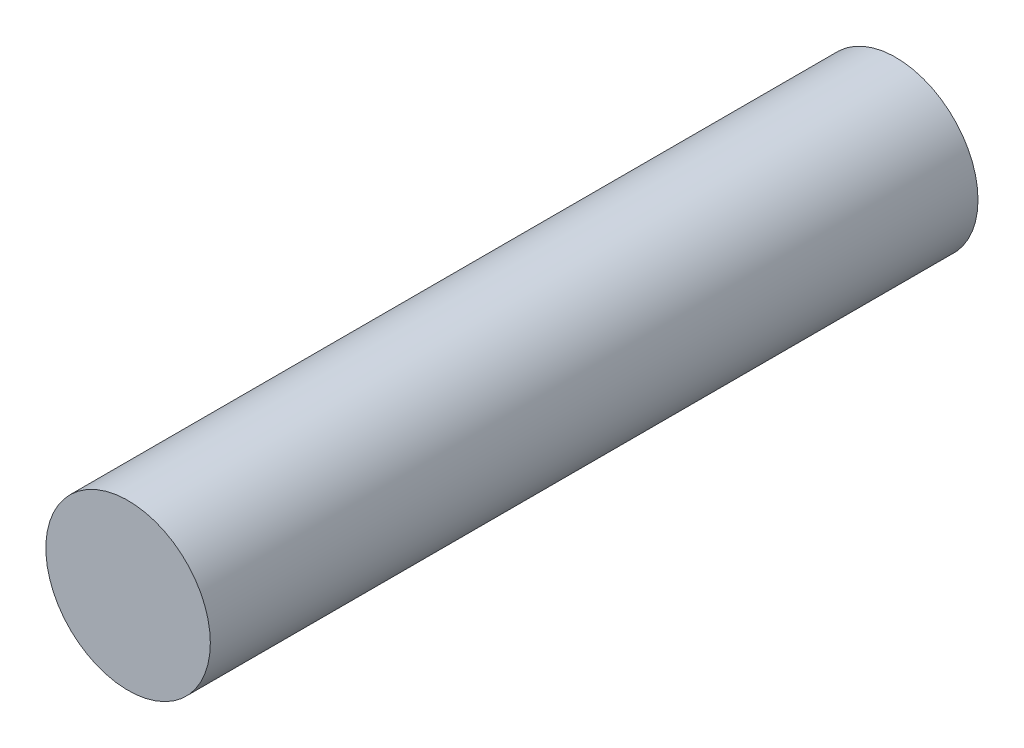
ISO-10303-21;
HEADER;
FILE_DESCRIPTION(('STEP AP214'),'2;1');
FILE_NAME('part.step','',(''),(''),'','','');
FILE_SCHEMA(('AUTOMOTIVE_DESIGN { 1 0 10303 214 1 1 1 1 }'));
ENDSEC;
DATA;
#1=APPLICATION_CONTEXT('core data for automotive mechanical design processes');
#2=APPLICATION_PROTOCOL_DEFINITION('international standard','automotive_design',2000,#1);
#3=PRODUCT_CONTEXT('',#1,'mechanical');
#4=PRODUCT('Part','Part','',(#3));
#5=PRODUCT_RELATED_PRODUCT_CATEGORY('part','',(#4));
#6=PRODUCT_DEFINITION_FORMATION('','',#4);
#7=PRODUCT_DEFINITION_CONTEXT('part definition',#1,'design');
#8=PRODUCT_DEFINITION('design','',#6,#7);
#9=PRODUCT_DEFINITION_SHAPE('','',#8);
#10=(LENGTH_UNIT() NAMED_UNIT(*) SI_UNIT(.MILLI.,.METRE.));
#11=(NAMED_UNIT(*) PLANE_ANGLE_UNIT() SI_UNIT($,.RADIAN.));
#12=(NAMED_UNIT(*) SI_UNIT($,.STERADIAN.) SOLID_ANGLE_UNIT());
#13=UNCERTAINTY_MEASURE_WITH_UNIT(LENGTH_MEASURE(1.E-05),#10,'distance_accuracy_value','');
#14=(GEOMETRIC_REPRESENTATION_CONTEXT(3) GLOBAL_UNCERTAINTY_ASSIGNED_CONTEXT((#13)) GLOBAL_UNIT_ASSIGNED_CONTEXT((#10,
#11,#12)) REPRESENTATION_CONTEXT('',''));
#15=CARTESIAN_POINT('',(0.,0.,0.));
#16=DIRECTION('',(0.,0.,1.));
#17=DIRECTION('',(1.,0.,0.));
#18=AXIS2_PLACEMENT_3D('',#15,#16,#17);
#19=CARTESIAN_POINT('',(0.,0.,14.));
#20=DIRECTION('',(0.,0.,-1.));
#21=DIRECTION('',(-1.,0.,0.));
#22=AXIS2_PLACEMENT_3D('',#19,#20,#21);
#23=CYLINDRICAL_SURFACE('',#22,1.5);
#24=CARTESIAN_POINT('',(0.,0.,14.));
#25=DIRECTION('',(0.,0.,1.));
#26=DIRECTION('',(1.,0.,0.));
#27=AXIS2_PLACEMENT_3D('',#24,#25,#26);
#28=CIRCLE('',#27,1.5);
#29=CARTESIAN_POINT('',(1.5,0.,14.));
#30=VERTEX_POINT('',#29);
#31=EDGE_CURVE('E10',#30,#30,#28,.T.);
#32=ORIENTED_EDGE('',*,*,#31,.F.);
#33=EDGE_LOOP('',(#32));
#34=FACE_BOUND('',#33,.T.);
#35=CARTESIAN_POINT('',(0.,0.,0.));
#36=DIRECTION('',(0.,0.,1.));
#37=DIRECTION('',(1.,0.,0.));
#38=AXIS2_PLACEMENT_3D('',#35,#36,#37);
#39=CIRCLE('',#38,1.5);
#40=CARTESIAN_POINT('',(1.5,0.,0.));
#41=VERTEX_POINT('',#40);
#42=EDGE_CURVE('E44',#41,#41,#39,.T.);
#43=ORIENTED_EDGE('',*,*,#42,.T.);
#44=EDGE_LOOP('',(#43));
#45=FACE_BOUND('',#44,.T.);
#46=ADVANCED_FACE('F41',(#34,#45),#23,.T.);
#47=CARTESIAN_POINT('',(0.,0.,14.));
#48=DIRECTION('',(0.,0.,1.));
#49=DIRECTION('',(1.,0.,0.));
#50=AXIS2_PLACEMENT_3D('',#47,#48,#49);
#51=PLANE('',#50);
#52=ORIENTED_EDGE('',*,*,#31,.T.);
#53=EDGE_LOOP('',(#52));
#54=FACE_BOUND('',#53,.T.);
#55=ADVANCED_FACE('F58',(#54),#51,.T.);
#56=CARTESIAN_POINT('',(0.,0.,0.));
#57=DIRECTION('',(0.,0.,1.));
#58=DIRECTION('',(1.,0.,0.));
#59=AXIS2_PLACEMENT_3D('',#56,#57,#58);
#60=PLANE('',#59);
#61=ORIENTED_EDGE('',*,*,#42,.F.);
#62=EDGE_LOOP('',(#61));
#63=FACE_BOUND('',#62,.T.);
#64=ADVANCED_FACE('F56',(#63),#60,.F.);
#65=CLOSED_SHELL('',(#46,#55,#64));
#66=MANIFOLD_SOLID_BREP('B2',#65);
#67=ADVANCED_BREP_SHAPE_REPRESENTATION('',(#18,#66),#14);
#68=SHAPE_DEFINITION_REPRESENTATION(#9,#67);
ENDSEC;
END-ISO-10303-21;
